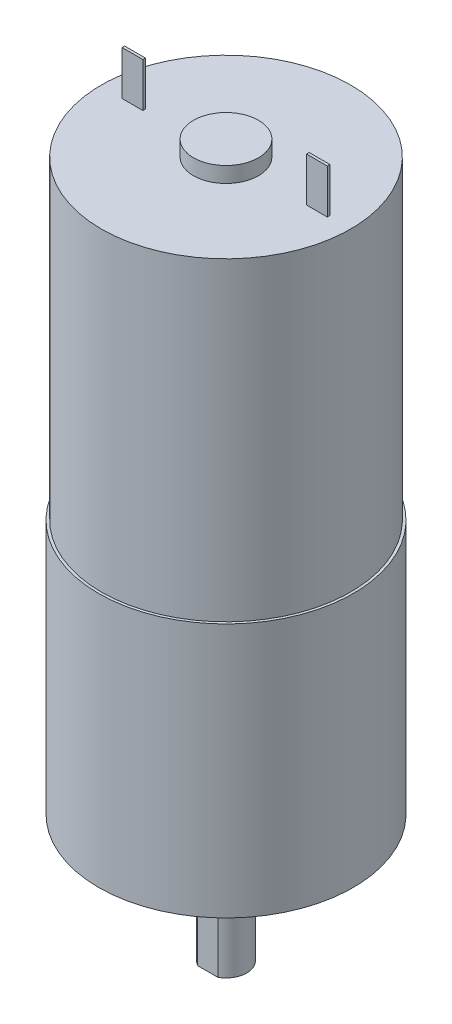
ISO-10303-21;
HEADER;
FILE_DESCRIPTION(('STEP AP214'),'2;1');
FILE_NAME('part.step','',(''),(''),'','','');
FILE_SCHEMA(('AUTOMOTIVE_DESIGN { 1 0 10303 214 1 1 1 1 }'));
ENDSEC;
DATA;
#1=APPLICATION_CONTEXT('core data for automotive mechanical design processes');
#2=APPLICATION_PROTOCOL_DEFINITION('international standard','automotive_design',2000,#1);
#3=PRODUCT_CONTEXT('',#1,'mechanical');
#4=PRODUCT('Part','Part','',(#3));
#5=PRODUCT_RELATED_PRODUCT_CATEGORY('part','',(#4));
#6=PRODUCT_DEFINITION_FORMATION('','',#4);
#7=PRODUCT_DEFINITION_CONTEXT('part definition',#1,'design');
#8=PRODUCT_DEFINITION('design','',#6,#7);
#9=PRODUCT_DEFINITION_SHAPE('','',#8);
#10=(LENGTH_UNIT() NAMED_UNIT(*) SI_UNIT(.MILLI.,.METRE.));
#11=(NAMED_UNIT(*) PLANE_ANGLE_UNIT() SI_UNIT($,.RADIAN.));
#12=(NAMED_UNIT(*) SI_UNIT($,.STERADIAN.) SOLID_ANGLE_UNIT());
#13=UNCERTAINTY_MEASURE_WITH_UNIT(LENGTH_MEASURE(1.E-05),#10,'distance_accuracy_value','');
#14=(GEOMETRIC_REPRESENTATION_CONTEXT(3) GLOBAL_UNCERTAINTY_ASSIGNED_CONTEXT((#13)) GLOBAL_UNIT_ASSIGNED_CONTEXT((#10,
#11,#12)) REPRESENTATION_CONTEXT('',''));
#15=CARTESIAN_POINT('',(0.,0.,0.));
#16=DIRECTION('',(0.,0.,1.));
#17=DIRECTION('',(1.,0.,0.));
#18=AXIS2_PLACEMENT_3D('',#15,#16,#17);
#19=CARTESIAN_POINT('',(0.,55.626,0.));
#20=DIRECTION('',(0.,1.,0.));
#21=DIRECTION('',(0.,0.,1.));
#22=AXIS2_PLACEMENT_3D('',#19,#20,#21);
#23=PLANE('',#22);
#24=CARTESIAN_POINT('',(0.,55.626,0.));
#25=DIRECTION('',(0.,1.,0.));
#26=DIRECTION('',(0.,0.,1.));
#27=AXIS2_PLACEMENT_3D('',#24,#25,#26);
#28=CIRCLE('',#27,3.175);
#29=CARTESIAN_POINT('',(0.,55.626,3.175));
#30=VERTEX_POINT('',#29);
#31=EDGE_CURVE('E11',#30,#30,#28,.T.);
#32=ORIENTED_EDGE('',*,*,#31,.F.);
#33=EDGE_LOOP('',(#32));
#34=FACE_BOUND('',#33,.T.);
#35=CARTESIAN_POINT('',(0.,55.626,0.));
#36=DIRECTION('',(0.,1.,0.));
#37=DIRECTION('',(0.,0.,1.));
#38=AXIS2_PLACEMENT_3D('',#35,#36,#37);
#39=CIRCLE('',#38,12.192);
#40=CARTESIAN_POINT('',(0.,55.626,12.192));
#41=VERTEX_POINT('',#40);
#42=EDGE_CURVE('E246',#41,#41,#39,.T.);
#43=ORIENTED_EDGE('',*,*,#42,.T.);
#44=EDGE_LOOP('',(#43));
#45=FACE_BOUND('',#44,.T.);
#46=DIRECTION('',(-1.,0.,0.));
#47=VECTOR('',#46,1.);
#48=CARTESIAN_POINT('',(-10.033,55.626,-0.126999999999998));
#49=LINE('',#48,#47);
#50=CARTESIAN_POINT('',(-8.001,55.626,-0.127000000000001));
#51=VERTEX_POINT('',#50);
#52=CARTESIAN_POINT('',(-10.033,55.626,-0.126999999999998));
#53=VERTEX_POINT('',#52);
#54=EDGE_CURVE('E164',#51,#53,#49,.T.);
#55=ORIENTED_EDGE('',*,*,#54,.F.);
#56=DIRECTION('',(0.,0.,-1.));
#57=VECTOR('',#56,1.);
#58=CARTESIAN_POINT('',(-8.001,55.626,0.126999999999999));
#59=LINE('',#58,#57);
#60=CARTESIAN_POINT('',(-8.001,55.626,0.126999999999999));
#61=VERTEX_POINT('',#60);
#62=EDGE_CURVE('E159',#61,#51,#59,.T.);
#63=ORIENTED_EDGE('',*,*,#62,.F.);
#64=DIRECTION('',(1.,0.,0.));
#65=VECTOR('',#64,1.);
#66=CARTESIAN_POINT('',(-10.033,55.626,0.126999999999998));
#67=LINE('',#66,#65);
#68=CARTESIAN_POINT('',(-10.033,55.626,0.126999999999998));
#69=VERTEX_POINT('',#68);
#70=EDGE_CURVE('E174',#69,#61,#67,.T.);
#71=ORIENTED_EDGE('',*,*,#70,.F.);
#72=DIRECTION('',(0.,0.,1.));
#73=VECTOR('',#72,1.);
#74=CARTESIAN_POINT('',(-10.033,55.626,0.126999999999998));
#75=LINE('',#74,#73);
#76=EDGE_CURVE('E186',#53,#69,#75,.T.);
#77=ORIENTED_EDGE('',*,*,#76,.F.);
#78=EDGE_LOOP('',(#55,#63,#71,#77));
#79=FACE_BOUND('',#78,.T.);
#80=DIRECTION('',(1.,0.,0.));
#81=VECTOR('',#80,1.);
#82=CARTESIAN_POINT('',(10.033,55.626,0.126999999999998));
#83=LINE('',#82,#81);
#84=CARTESIAN_POINT('',(8.00099999999998,55.626,0.126999999999998));
#85=VERTEX_POINT('',#84);
#86=CARTESIAN_POINT('',(10.033,55.626,0.126999999999998));
#87=VERTEX_POINT('',#86);
#88=EDGE_CURVE('E674',#85,#87,#83,.T.);
#89=ORIENTED_EDGE('',*,*,#88,.F.);
#90=DIRECTION('',(0.,0.,1.));
#91=VECTOR('',#90,1.);
#92=CARTESIAN_POINT('',(8.00099999999998,55.626,0.126999999999998));
#93=LINE('',#92,#91);
#94=CARTESIAN_POINT('',(8.00099999999998,55.626,-0.127000000000002));
#95=VERTEX_POINT('',#94);
#96=EDGE_CURVE('E156',#95,#85,#93,.T.);
#97=ORIENTED_EDGE('',*,*,#96,.F.);
#98=DIRECTION('',(-1.,0.,0.));
#99=VECTOR('',#98,1.);
#100=CARTESIAN_POINT('',(10.033,55.626,-0.126999999999998));
#101=LINE('',#100,#99);
#102=CARTESIAN_POINT('',(10.033,55.626,-0.126999999999998));
#103=VERTEX_POINT('',#102);
#104=EDGE_CURVE('E152',#103,#95,#101,.T.);
#105=ORIENTED_EDGE('',*,*,#104,.F.);
#106=DIRECTION('',(0.,0.,-1.));
#107=VECTOR('',#106,1.);
#108=CARTESIAN_POINT('',(10.033,55.626,0.126999999999998));
#109=LINE('',#108,#107);
#110=EDGE_CURVE('E670',#87,#103,#109,.T.);
#111=ORIENTED_EDGE('',*,*,#110,.F.);
#112=EDGE_LOOP('',(#89,#97,#105,#111));
#113=FACE_BOUND('',#112,.T.);
#114=ADVANCED_FACE('F39',(#34,#45,#79,#113),#23,.T.);
#115=CARTESIAN_POINT('',(0.,-12.446,0.));
#116=DIRECTION('',(0.,1.,0.));
#117=DIRECTION('',(0.,0.,1.));
#118=AXIS2_PLACEMENT_3D('',#115,#116,#117);
#119=CYLINDRICAL_SURFACE('',#118,2.032);
#120=CARTESIAN_POINT('',(0.,-12.446,0.));
#121=DIRECTION('',(0.,-1.,0.));
#122=DIRECTION('',(0.,0.,-1.));
#123=AXIS2_PLACEMENT_3D('',#120,#121,#122);
#124=CIRCLE('',#123,2.032);
#125=CARTESIAN_POINT('',(-0.983737769936686,-12.446,1.778));
#126=VERTEX_POINT('',#125);
#127=CARTESIAN_POINT('',(-0.983737769936686,-12.446,-1.778));
#128=VERTEX_POINT('',#127);
#129=EDGE_CURVE('E231',#126,#128,#124,.T.);
#130=ORIENTED_EDGE('',*,*,#129,.F.);
#131=DIRECTION('',(0.,1.,0.));
#132=VECTOR('',#131,1.);
#133=CARTESIAN_POINT('',(-0.983737769936686,-12.446,1.778));
#134=LINE('',#133,#132);
#135=CARTESIAN_POINT('',(-0.983737769936686,-2.54,1.778));
#136=VERTEX_POINT('',#135);
#137=EDGE_CURVE('E227',#126,#136,#134,.T.);
#138=ORIENTED_EDGE('',*,*,#137,.T.);
#139=CARTESIAN_POINT('',(0.,-2.54,0.));
#140=DIRECTION('',(0.,-1.,0.));
#141=DIRECTION('',(0.,0.,-1.));
#142=AXIS2_PLACEMENT_3D('',#139,#140,#141);
#143=CIRCLE('',#142,2.032);
#144=CARTESIAN_POINT('',(-0.983737769936686,-2.54,-1.778));
#145=VERTEX_POINT('',#144);
#146=EDGE_CURVE('E236',#136,#145,#143,.T.);
#147=ORIENTED_EDGE('',*,*,#146,.T.);
#148=DIRECTION('',(0.,1.,0.));
#149=VECTOR('',#148,1.);
#150=CARTESIAN_POINT('',(-0.983737769936686,-12.446,-1.778));
#151=LINE('',#150,#149);
#152=EDGE_CURVE('E212',#145,#128,#151,.F.);
#153=ORIENTED_EDGE('',*,*,#152,.T.);
#154=EDGE_LOOP('',(#130,#138,#147,#153));
#155=FACE_BOUND('',#154,.T.);
#156=ADVANCED_FACE('F325',(#155),#119,.T.);
#157=CARTESIAN_POINT('',(0.,24.892,0.));
#158=DIRECTION('',(0.,1.,0.));
#159=DIRECTION('',(0.,0.,1.));
#160=AXIS2_PLACEMENT_3D('',#157,#158,#159);
#161=PLANE('',#160);
#162=CARTESIAN_POINT('',(0.,24.892,0.));
#163=DIRECTION('',(0.,1.,0.));
#164=DIRECTION('',(0.,0.,1.));
#165=AXIS2_PLACEMENT_3D('',#162,#163,#164);
#166=CIRCLE('',#165,12.192);
#167=CARTESIAN_POINT('',(0.,24.892,12.192));
#168=VERTEX_POINT('',#167);
#169=EDGE_CURVE('E241',#168,#168,#166,.T.);
#170=ORIENTED_EDGE('',*,*,#169,.F.);
#171=EDGE_LOOP('',(#170));
#172=FACE_BOUND('',#171,.T.);
#173=CARTESIAN_POINT('',(0.,24.892,0.));
#174=DIRECTION('',(0.,1.,0.));
#175=DIRECTION('',(0.,0.,1.));
#176=AXIS2_PLACEMENT_3D('',#173,#174,#175);
#177=CIRCLE('',#176,12.446);
#178=CARTESIAN_POINT('',(0.,24.892,12.446));
#179=VERTEX_POINT('',#178);
#180=EDGE_CURVE('E258',#179,#179,#177,.T.);
#181=ORIENTED_EDGE('',*,*,#180,.T.);
#182=EDGE_LOOP('',(#181));
#183=FACE_BOUND('',#182,.T.);
#184=ADVANCED_FACE('F344',(#172,#183),#161,.T.);
#185=CARTESIAN_POINT('',(0.,0.,0.));
#186=DIRECTION('',(0.,1.,0.));
#187=DIRECTION('',(0.,0.,1.));
#188=AXIS2_PLACEMENT_3D('',#185,#186,#187);
#189=PLANE('',#188);
#190=CARTESIAN_POINT('',(0.,0.,0.));
#191=DIRECTION('',(0.,1.,0.));
#192=DIRECTION('',(0.,0.,1.));
#193=AXIS2_PLACEMENT_3D('',#190,#191,#192);
#194=CIRCLE('',#193,3.556);
#195=CARTESIAN_POINT('',(0.,0.,3.556));
#196=VERTEX_POINT('',#195);
#197=EDGE_CURVE('E247',#196,#196,#194,.T.);
#198=ORIENTED_EDGE('',*,*,#197,.T.);
#199=EDGE_LOOP('',(#198));
#200=FACE_BOUND('',#199,.T.);
#201=CARTESIAN_POINT('',(0.,0.,-8.11986596766364));
#202=DIRECTION('',(0.,1.,0.));
#203=DIRECTION('',(0.,0.,1.));
#204=AXIS2_PLACEMENT_3D('',#201,#202,#203);
#205=CIRCLE('',#204,1.69999999999999);
#206=CARTESIAN_POINT('',(0.,0.,-6.41986596766364));
#207=VERTEX_POINT('',#206);
#208=EDGE_CURVE('E268',#207,#207,#205,.T.);
#209=ORIENTED_EDGE('',*,*,#208,.T.);
#210=EDGE_LOOP('',(#209));
#211=FACE_BOUND('',#210,.T.);
#212=CARTESIAN_POINT('',(0.,0.,7.58703619407051));
#213=DIRECTION('',(0.,1.,0.));
#214=DIRECTION('',(0.,0.,1.));
#215=AXIS2_PLACEMENT_3D('',#212,#213,#214);
#216=CIRCLE('',#215,1.69999999999999);
#217=CARTESIAN_POINT('',(0.,0.,9.2870361940705));
#218=VERTEX_POINT('',#217);
#219=EDGE_CURVE('E280',#218,#218,#216,.T.);
#220=ORIENTED_EDGE('',*,*,#219,.T.);
#221=EDGE_LOOP('',(#220));
#222=FACE_BOUND('',#221,.T.);
#223=CARTESIAN_POINT('',(0.,0.,0.));
#224=DIRECTION('',(0.,1.,0.));
#225=DIRECTION('',(0.,0.,1.));
#226=AXIS2_PLACEMENT_3D('',#223,#224,#225);
#227=CIRCLE('',#226,12.446);
#228=CARTESIAN_POINT('',(0.,0.,12.446));
#229=VERTEX_POINT('',#228);
#230=EDGE_CURVE('E298',#229,#229,#227,.T.);
#231=ORIENTED_EDGE('',*,*,#230,.F.);
#232=EDGE_LOOP('',(#231));
#233=FACE_BOUND('',#232,.T.);
#234=CARTESIAN_POINT('',(-9.017,0.,0.));
#235=DIRECTION('',(0.,1.,0.));
#236=DIRECTION('',(0.,0.,1.));
#237=AXIS2_PLACEMENT_3D('',#234,#235,#236);
#238=CIRCLE('',#237,1.27);
#239=CARTESIAN_POINT('',(-9.017,0.,1.27));
#240=VERTEX_POINT('',#239);
#241=EDGE_CURVE('E291',#240,#240,#238,.T.);
#242=ORIENTED_EDGE('',*,*,#241,.T.);
#243=EDGE_LOOP('',(#242));
#244=FACE_BOUND('',#243,.T.);
#245=CARTESIAN_POINT('',(9.017,0.,0.));
#246=DIRECTION('',(0.,1.,0.));
#247=DIRECTION('',(0.,0.,1.));
#248=AXIS2_PLACEMENT_3D('',#245,#246,#247);
#249=CIRCLE('',#248,1.27);
#250=CARTESIAN_POINT('',(9.017,0.,1.27));
#251=VERTEX_POINT('',#250);
#252=EDGE_CURVE('E284',#251,#251,#249,.T.);
#253=ORIENTED_EDGE('',*,*,#252,.T.);
#254=EDGE_LOOP('',(#253));
#255=FACE_BOUND('',#254,.T.);
#256=ADVANCED_FACE('F386',(#200,#211,#222,#233,#244,#255),#189,.F.);
#257=CARTESIAN_POINT('',(0.,24.892,0.));
#258=DIRECTION('',(0.,-1.,0.));
#259=DIRECTION('',(0.,0.,-1.));
#260=AXIS2_PLACEMENT_3D('',#257,#258,#259);
#261=CYLINDRICAL_SURFACE('',#260,12.446);
#262=ORIENTED_EDGE('',*,*,#180,.F.);
#263=EDGE_LOOP('',(#262));
#264=FACE_BOUND('',#263,.T.);
#265=ORIENTED_EDGE('',*,*,#230,.T.);
#266=EDGE_LOOP('',(#265));
#267=FACE_BOUND('',#266,.T.);
#268=ADVANCED_FACE('F41',(#264,#267),#261,.T.);
#269=CARTESIAN_POINT('',(-9.017,24.892,0.));
#270=DIRECTION('',(0.,-1.,0.));
#271=DIRECTION('',(0.,0.,-1.));
#272=AXIS2_PLACEMENT_3D('',#269,#270,#271);
#273=CYLINDRICAL_SURFACE('',#272,1.27);
#274=CARTESIAN_POINT('',(-9.017,24.892,0.));
#275=DIRECTION('',(0.,1.,0.));
#276=DIRECTION('',(0.,0.,1.));
#277=AXIS2_PLACEMENT_3D('',#274,#275,#276);
#278=CIRCLE('',#277,1.27);
#279=CARTESIAN_POINT('',(-9.017,24.892,1.27));
#280=VERTEX_POINT('',#279);
#281=EDGE_CURVE('E276',#280,#280,#278,.T.);
#282=ORIENTED_EDGE('',*,*,#281,.T.);
#283=EDGE_LOOP('',(#282));
#284=FACE_BOUND('',#283,.T.);
#285=ORIENTED_EDGE('',*,*,#241,.F.);
#286=EDGE_LOOP('',(#285));
#287=FACE_BOUND('',#286,.T.);
#288=ADVANCED_FACE('F380',(#284,#287),#273,.F.);
#289=CARTESIAN_POINT('',(9.017,24.892,0.));
#290=DIRECTION('',(0.,-1.,0.));
#291=DIRECTION('',(0.,0.,-1.));
#292=AXIS2_PLACEMENT_3D('',#289,#290,#291);
#293=CYLINDRICAL_SURFACE('',#292,1.27);
#294=CARTESIAN_POINT('',(9.017,24.892,0.));
#295=DIRECTION('',(0.,1.,0.));
#296=DIRECTION('',(0.,0.,1.));
#297=AXIS2_PLACEMENT_3D('',#294,#295,#296);
#298=CIRCLE('',#297,1.27);
#299=CARTESIAN_POINT('',(9.017,24.892,1.27));
#300=VERTEX_POINT('',#299);
#301=EDGE_CURVE('E254',#300,#300,#298,.T.);
#302=ORIENTED_EDGE('',*,*,#301,.T.);
#303=EDGE_LOOP('',(#302));
#304=FACE_BOUND('',#303,.T.);
#305=ORIENTED_EDGE('',*,*,#252,.F.);
#306=EDGE_LOOP('',(#305));
#307=FACE_BOUND('',#306,.T.);
#308=ADVANCED_FACE('F376',(#304,#307),#293,.F.);
#309=CARTESIAN_POINT('',(0.,24.892,7.58703619407051));
#310=DIRECTION('',(0.,1.,0.));
#311=DIRECTION('',(0.,0.,1.));
#312=AXIS2_PLACEMENT_3D('',#309,#310,#311);
#313=CYLINDRICAL_SURFACE('',#312,1.7);
#314=ORIENTED_EDGE('',*,*,#219,.F.);
#315=EDGE_LOOP('',(#314));
#316=FACE_BOUND('',#315,.T.);
#317=CARTESIAN_POINT('',(0.,23.442,7.58703619407051));
#318=DIRECTION('',(0.,1.,0.));
#319=DIRECTION('',(0.,0.,1.));
#320=AXIS2_PLACEMENT_3D('',#317,#318,#319);
#321=CIRCLE('',#320,1.7);
#322=CARTESIAN_POINT('',(0.,23.442,9.28703619407051));
#323=VERTEX_POINT('',#322);
#324=EDGE_CURVE('E272',#323,#323,#321,.T.);
#325=ORIENTED_EDGE('',*,*,#324,.T.);
#326=EDGE_LOOP('',(#325));
#327=FACE_BOUND('',#326,.T.);
#328=ADVANCED_FACE('F372',(#316,#327),#313,.F.);
#329=CARTESIAN_POINT('',(0.,24.892,7.58703619407051));
#330=DIRECTION('',(0.,1.,0.));
#331=DIRECTION('',(0.,0.,1.));
#332=AXIS2_PLACEMENT_3D('',#329,#330,#331);
#333=CONICAL_SURFACE('',#332,3.15,0.785398163397449);
#334=ORIENTED_EDGE('',*,*,#324,.F.);
#335=EDGE_LOOP('',(#334));
#336=FACE_BOUND('',#335,.T.);
#337=CARTESIAN_POINT('',(0.,24.892,7.58703619407051));
#338=DIRECTION('',(0.,1.,0.));
#339=DIRECTION('',(0.,0.,1.));
#340=AXIS2_PLACEMENT_3D('',#337,#338,#339);
#341=CIRCLE('',#340,3.15);
#342=CARTESIAN_POINT('',(0.,24.892,10.7370361940705));
#343=VERTEX_POINT('',#342);
#344=EDGE_CURVE('E264',#343,#343,#341,.T.);
#345=ORIENTED_EDGE('',*,*,#344,.T.);
#346=EDGE_LOOP('',(#345));
#347=FACE_BOUND('',#346,.T.);
#348=ADVANCED_FACE('F368',(#336,#347),#333,.F.);
#349=CARTESIAN_POINT('',(0.,24.892,-8.11986596766364));
#350=DIRECTION('',(0.,1.,0.));
#351=DIRECTION('',(0.,0.,1.));
#352=AXIS2_PLACEMENT_3D('',#349,#350,#351);
#353=CYLINDRICAL_SURFACE('',#352,1.7);
#354=ORIENTED_EDGE('',*,*,#208,.F.);
#355=EDGE_LOOP('',(#354));
#356=FACE_BOUND('',#355,.T.);
#357=CARTESIAN_POINT('',(0.,23.442,-8.11986596766364));
#358=DIRECTION('',(0.,1.,0.));
#359=DIRECTION('',(0.,0.,1.));
#360=AXIS2_PLACEMENT_3D('',#357,#358,#359);
#361=CIRCLE('',#360,1.7);
#362=CARTESIAN_POINT('',(0.,23.442,-6.41986596766364));
#363=VERTEX_POINT('',#362);
#364=EDGE_CURVE('E263',#363,#363,#361,.T.);
#365=ORIENTED_EDGE('',*,*,#364,.T.);
#366=EDGE_LOOP('',(#365));
#367=FACE_BOUND('',#366,.T.);
#368=ADVANCED_FACE('F364',(#356,#367),#353,.F.);
#369=CARTESIAN_POINT('',(0.,24.892,-8.11986596766364));
#370=DIRECTION('',(0.,1.,0.));
#371=DIRECTION('',(0.,0.,1.));
#372=AXIS2_PLACEMENT_3D('',#369,#370,#371);
#373=CONICAL_SURFACE('',#372,3.15,0.785398163397449);
#374=ORIENTED_EDGE('',*,*,#364,.F.);
#375=EDGE_LOOP('',(#374));
#376=FACE_BOUND('',#375,.T.);
#377=CARTESIAN_POINT('',(0.,24.892,-8.11986596766364));
#378=DIRECTION('',(0.,1.,0.));
#379=DIRECTION('',(0.,0.,1.));
#380=AXIS2_PLACEMENT_3D('',#377,#378,#379);
#381=CIRCLE('',#380,3.15);
#382=CARTESIAN_POINT('',(0.,24.892,-4.96986596766364));
#383=VERTEX_POINT('',#382);
#384=EDGE_CURVE('E259',#383,#383,#381,.T.);
#385=ORIENTED_EDGE('',*,*,#384,.T.);
#386=EDGE_LOOP('',(#385));
#387=FACE_BOUND('',#386,.T.);
#388=ADVANCED_FACE('F360',(#376,#387),#373,.F.);
#389=CARTESIAN_POINT('',(0.,55.626,0.));
#390=DIRECTION('',(0.,-1.,0.));
#391=DIRECTION('',(0.,0.,-1.));
#392=AXIS2_PLACEMENT_3D('',#389,#390,#391);
#393=CYLINDRICAL_SURFACE('',#392,12.192);
#394=ORIENTED_EDGE('',*,*,#42,.F.);
#395=EDGE_LOOP('',(#394));
#396=FACE_BOUND('',#395,.T.);
#397=ORIENTED_EDGE('',*,*,#169,.T.);
#398=EDGE_LOOP('',(#397));
#399=FACE_BOUND('',#398,.T.);
#400=ADVANCED_FACE('F355',(#396,#399),#393,.T.);
#401=CARTESIAN_POINT('',(0.,24.892,0.));
#402=DIRECTION('',(0.,1.,0.));
#403=DIRECTION('',(0.,0.,1.));
#404=AXIS2_PLACEMENT_3D('',#401,#402,#403);
#405=PLANE('',#404);
#406=ORIENTED_EDGE('',*,*,#301,.F.);
#407=EDGE_LOOP('',(#406));
#408=FACE_BOUND('',#407,.T.);
#409=ADVANCED_FACE('F351',(#408),#405,.F.);
#410=ORIENTED_EDGE('',*,*,#281,.F.);
#411=EDGE_LOOP('',(#410));
#412=FACE_BOUND('',#411,.T.);
#413=ADVANCED_FACE('F354',(#412),#405,.F.);
#414=ORIENTED_EDGE('',*,*,#344,.F.);
#415=EDGE_LOOP('',(#414));
#416=FACE_BOUND('',#415,.T.);
#417=ADVANCED_FACE('F413',(#416),#405,.F.);
#418=ORIENTED_EDGE('',*,*,#384,.F.);
#419=EDGE_LOOP('',(#418));
#420=FACE_BOUND('',#419,.T.);
#421=ADVANCED_FACE('F357',(#420),#405,.F.);
#422=CARTESIAN_POINT('',(0.,-2.54,0.));
#423=DIRECTION('',(0.,1.,0.));
#424=DIRECTION('',(0.,0.,1.));
#425=AXIS2_PLACEMENT_3D('',#422,#423,#424);
#426=CYLINDRICAL_SURFACE('',#425,3.556);
#427=CARTESIAN_POINT('',(0.,-2.54,0.));
#428=DIRECTION('',(0.,1.,0.));
#429=DIRECTION('',(0.,0.,1.));
#430=AXIS2_PLACEMENT_3D('',#427,#428,#429);
#431=CIRCLE('',#430,3.556);
#432=CARTESIAN_POINT('',(0.,-2.54,3.556));
#433=VERTEX_POINT('',#432);
#434=EDGE_CURVE('E242',#433,#433,#431,.T.);
#435=ORIENTED_EDGE('',*,*,#434,.T.);
#436=EDGE_LOOP('',(#435));
#437=FACE_BOUND('',#436,.T.);
#438=ORIENTED_EDGE('',*,*,#197,.F.);
#439=EDGE_LOOP('',(#438));
#440=FACE_BOUND('',#439,.T.);
#441=ADVANCED_FACE('F349',(#437,#440),#426,.T.);
#442=CARTESIAN_POINT('',(0.,-2.54,0.));
#443=DIRECTION('',(0.,1.,0.));
#444=DIRECTION('',(0.,0.,1.));
#445=AXIS2_PLACEMENT_3D('',#442,#443,#444);
#446=PLANE('',#445);
#447=DIRECTION('',(1.,0.,0.));
#448=VECTOR('',#447,1.);
#449=CARTESIAN_POINT('',(1.016,-2.54,1.778));
#450=LINE('',#449,#448);
#451=CARTESIAN_POINT('',(0.983737769936686,-2.54,1.778));
#452=VERTEX_POINT('',#451);
#453=EDGE_CURVE('E208',#136,#452,#450,.T.);
#454=ORIENTED_EDGE('',*,*,#453,.T.);
#455=CARTESIAN_POINT('',(0.983737769936686,-2.54,-1.778));
#456=VERTEX_POINT('',#455);
#457=EDGE_CURVE('E240',#456,#452,#143,.T.);
#458=ORIENTED_EDGE('',*,*,#457,.F.);
#459=DIRECTION('',(-1.,0.,0.));
#460=VECTOR('',#459,1.);
#461=CARTESIAN_POINT('',(1.016,-2.54,-1.778));
#462=LINE('',#461,#460);
#463=EDGE_CURVE('E206',#456,#145,#462,.T.);
#464=ORIENTED_EDGE('',*,*,#463,.T.);
#465=ORIENTED_EDGE('',*,*,#146,.F.);
#466=EDGE_LOOP('',(#454,#458,#464,#465));
#467=FACE_BOUND('',#466,.T.);
#468=ORIENTED_EDGE('',*,*,#434,.F.);
#469=EDGE_LOOP('',(#468));
#470=FACE_BOUND('',#469,.T.);
#471=ADVANCED_FACE('F317',(#467,#470),#446,.F.);
#472=ORIENTED_EDGE('',*,*,#457,.T.);
#473=DIRECTION('',(0.,1.,0.));
#474=VECTOR('',#473,1.);
#475=CARTESIAN_POINT('',(0.983737769936686,-12.446,1.778));
#476=LINE('',#475,#474);
#477=CARTESIAN_POINT('',(0.983737769936686,-12.446,1.778));
#478=VERTEX_POINT('',#477);
#479=EDGE_CURVE('E223',#452,#478,#476,.F.);
#480=ORIENTED_EDGE('',*,*,#479,.T.);
#481=CARTESIAN_POINT('',(0.983737769936686,-12.446,-1.778));
#482=VERTEX_POINT('',#481);
#483=EDGE_CURVE('E235',#482,#478,#124,.T.);
#484=ORIENTED_EDGE('',*,*,#483,.F.);
#485=DIRECTION('',(0.,1.,0.));
#486=VECTOR('',#485,1.);
#487=CARTESIAN_POINT('',(0.983737769936686,-12.446,-1.778));
#488=LINE('',#487,#486);
#489=EDGE_CURVE('E219',#482,#456,#488,.T.);
#490=ORIENTED_EDGE('',*,*,#489,.T.);
#491=EDGE_LOOP('',(#472,#480,#484,#490));
#492=FACE_BOUND('',#491,.T.);
#493=ADVANCED_FACE('F313',(#492),#119,.T.);
#494=CARTESIAN_POINT('',(0.,-12.446,0.));
#495=DIRECTION('',(0.,-1.,0.));
#496=DIRECTION('',(0.,0.,-1.));
#497=AXIS2_PLACEMENT_3D('',#494,#495,#496);
#498=PLANE('',#497);
#499=DIRECTION('',(1.,0.,0.));
#500=VECTOR('',#499,1.);
#501=CARTESIAN_POINT('',(0.,-12.446,1.778));
#502=LINE('',#501,#500);
#503=EDGE_CURVE('E43',#126,#478,#502,.T.);
#504=ORIENTED_EDGE('',*,*,#503,.F.);
#505=ORIENTED_EDGE('',*,*,#129,.T.);
#506=DIRECTION('',(-1.,0.,0.));
#507=VECTOR('',#506,1.);
#508=CARTESIAN_POINT('',(0.,-12.446,-1.778));
#509=LINE('',#508,#507);
#510=EDGE_CURVE('E304',#482,#128,#509,.T.);
#511=ORIENTED_EDGE('',*,*,#510,.F.);
#512=ORIENTED_EDGE('',*,*,#483,.T.);
#513=EDGE_LOOP('',(#504,#505,#511,#512));
#514=FACE_BOUND('',#513,.T.);
#515=ADVANCED_FACE('F327',(#514),#498,.T.);
#516=CARTESIAN_POINT('',(1.016,-2.54,-1.778));
#517=DIRECTION('',(0.,0.,1.));
#518=DIRECTION('',(1.,0.,0.));
#519=AXIS2_PLACEMENT_3D('',#516,#517,#518);
#520=PLANE('',#519);
#521=ORIENTED_EDGE('',*,*,#510,.T.);
#522=ORIENTED_EDGE('',*,*,#152,.F.);
#523=ORIENTED_EDGE('',*,*,#463,.F.);
#524=ORIENTED_EDGE('',*,*,#489,.F.);
#525=EDGE_LOOP('',(#521,#522,#523,#524));
#526=FACE_BOUND('',#525,.T.);
#527=ADVANCED_FACE('F330',(#526),#520,.F.);
#528=CARTESIAN_POINT('',(1.016,-2.54,1.778));
#529=DIRECTION('',(0.,0.,-1.));
#530=DIRECTION('',(-1.,0.,0.));
#531=AXIS2_PLACEMENT_3D('',#528,#529,#530);
#532=PLANE('',#531);
#533=ORIENTED_EDGE('',*,*,#503,.T.);
#534=ORIENTED_EDGE('',*,*,#479,.F.);
#535=ORIENTED_EDGE('',*,*,#453,.F.);
#536=ORIENTED_EDGE('',*,*,#137,.F.);
#537=EDGE_LOOP('',(#533,#534,#535,#536));
#538=FACE_BOUND('',#537,.T.);
#539=ADVANCED_FACE('F321',(#538),#532,.F.);
#540=CARTESIAN_POINT('',(0.,57.15,0.));
#541=DIRECTION('',(0.,-1.,0.));
#542=DIRECTION('',(0.,0.,-1.));
#543=AXIS2_PLACEMENT_3D('',#540,#541,#542);
#544=CYLINDRICAL_SURFACE('',#543,3.175);
#545=CARTESIAN_POINT('',(0.,57.15,0.));
#546=DIRECTION('',(0.,1.,0.));
#547=DIRECTION('',(0.,0.,1.));
#548=AXIS2_PLACEMENT_3D('',#545,#546,#547);
#549=CIRCLE('',#548,3.175);
#550=CARTESIAN_POINT('',(0.,57.15,3.175));
#551=VERTEX_POINT('',#550);
#552=EDGE_CURVE('E203',#551,#551,#549,.T.);
#553=ORIENTED_EDGE('',*,*,#552,.F.);
#554=EDGE_LOOP('',(#553));
#555=FACE_BOUND('',#554,.T.);
#556=ORIENTED_EDGE('',*,*,#31,.T.);
#557=EDGE_LOOP('',(#556));
#558=FACE_BOUND('',#557,.T.);
#559=ADVANCED_FACE('F546',(#555,#558),#544,.T.);
#560=CARTESIAN_POINT('',(0.,57.15,0.));
#561=DIRECTION('',(0.,1.,0.));
#562=DIRECTION('',(0.,0.,1.));
#563=AXIS2_PLACEMENT_3D('',#560,#561,#562);
#564=PLANE('',#563);
#565=ORIENTED_EDGE('',*,*,#552,.T.);
#566=EDGE_LOOP('',(#565));
#567=FACE_BOUND('',#566,.T.);
#568=ADVANCED_FACE('F555',(#567),#564,.T.);
#569=CARTESIAN_POINT('',(-8.001,59.944,0.126999999999999));
#570=DIRECTION('',(-1.,0.,0.));
#571=DIRECTION('',(0.,0.,1.));
#572=AXIS2_PLACEMENT_3D('',#569,#570,#571);
#573=PLANE('',#572);
#574=ORIENTED_EDGE('',*,*,#62,.T.);
#575=DIRECTION('',(0.,-1.,0.));
#576=VECTOR('',#575,1.);
#577=CARTESIAN_POINT('',(-8.001,59.944,-0.127000000000001));
#578=LINE('',#577,#576);
#579=CARTESIAN_POINT('',(-8.001,59.944,-0.127000000000001));
#580=VERTEX_POINT('',#579);
#581=EDGE_CURVE('E200',#580,#51,#578,.T.);
#582=ORIENTED_EDGE('',*,*,#581,.F.);
#583=DIRECTION('',(0.,0.,-1.));
#584=VECTOR('',#583,1.);
#585=CARTESIAN_POINT('',(-8.001,59.944,0.126999999999999));
#586=LINE('',#585,#584);
#587=CARTESIAN_POINT('',(-8.001,59.944,0.126999999999999));
#588=VERTEX_POINT('',#587);
#589=EDGE_CURVE('E169',#588,#580,#586,.T.);
#590=ORIENTED_EDGE('',*,*,#589,.F.);
#591=DIRECTION('',(0.,-1.,0.));
#592=VECTOR('',#591,1.);
#593=CARTESIAN_POINT('',(-8.001,59.944,0.126999999999999));
#594=LINE('',#593,#592);
#595=EDGE_CURVE('E182',#588,#61,#594,.T.);
#596=ORIENTED_EDGE('',*,*,#595,.T.);
#597=EDGE_LOOP('',(#574,#582,#590,#596));
#598=FACE_BOUND('',#597,.T.);
#599=ADVANCED_FACE('F564',(#598),#573,.F.);
#600=CARTESIAN_POINT('',(-10.033,59.944,-0.126999999999998));
#601=DIRECTION('',(0.,0.,1.));
#602=DIRECTION('',(1.,0.,0.));
#603=AXIS2_PLACEMENT_3D('',#600,#601,#602);
#604=PLANE('',#603);
#605=ORIENTED_EDGE('',*,*,#54,.T.);
#606=DIRECTION('',(0.,-1.,0.));
#607=VECTOR('',#606,1.);
#608=CARTESIAN_POINT('',(-10.033,59.944,-0.126999999999998));
#609=LINE('',#608,#607);
#610=CARTESIAN_POINT('',(-10.033,59.944,-0.126999999999998));
#611=VERTEX_POINT('',#610);
#612=EDGE_CURVE('E196',#611,#53,#609,.T.);
#613=ORIENTED_EDGE('',*,*,#612,.F.);
#614=DIRECTION('',(-1.,0.,0.));
#615=VECTOR('',#614,1.);
#616=CARTESIAN_POINT('',(-10.033,59.944,-0.126999999999998));
#617=LINE('',#616,#615);
#618=EDGE_CURVE('E173',#580,#611,#617,.T.);
#619=ORIENTED_EDGE('',*,*,#618,.F.);
#620=ORIENTED_EDGE('',*,*,#581,.T.);
#621=EDGE_LOOP('',(#605,#613,#619,#620));
#622=FACE_BOUND('',#621,.T.);
#623=ADVANCED_FACE('F579',(#622),#604,.F.);
#624=CARTESIAN_POINT('',(-10.033,59.944,0.126999999999998));
#625=DIRECTION('',(1.,0.,0.));
#626=DIRECTION('',(0.,0.,-1.));
#627=AXIS2_PLACEMENT_3D('',#624,#625,#626);
#628=PLANE('',#627);
#629=ORIENTED_EDGE('',*,*,#76,.T.);
#630=DIRECTION('',(0.,-1.,0.));
#631=VECTOR('',#630,1.);
#632=CARTESIAN_POINT('',(-10.033,59.944,0.126999999999998));
#633=LINE('',#632,#631);
#634=CARTESIAN_POINT('',(-10.033,59.944,0.126999999999998));
#635=VERTEX_POINT('',#634);
#636=EDGE_CURVE('E64',#635,#69,#633,.T.);
#637=ORIENTED_EDGE('',*,*,#636,.F.);
#638=DIRECTION('',(0.,0.,1.));
#639=VECTOR('',#638,1.);
#640=CARTESIAN_POINT('',(-10.033,59.944,0.126999999999998));
#641=LINE('',#640,#639);
#642=EDGE_CURVE('E177',#611,#635,#641,.T.);
#643=ORIENTED_EDGE('',*,*,#642,.F.);
#644=ORIENTED_EDGE('',*,*,#612,.T.);
#645=EDGE_LOOP('',(#629,#637,#643,#644));
#646=FACE_BOUND('',#645,.T.);
#647=ADVANCED_FACE('F589',(#646),#628,.F.);
#648=CARTESIAN_POINT('',(-10.033,59.944,0.126999999999998));
#649=DIRECTION('',(0.,0.,-1.));
#650=DIRECTION('',(-1.,0.,0.));
#651=AXIS2_PLACEMENT_3D('',#648,#649,#650);
#652=PLANE('',#651);
#653=ORIENTED_EDGE('',*,*,#70,.T.);
#654=ORIENTED_EDGE('',*,*,#595,.F.);
#655=DIRECTION('',(1.,0.,0.));
#656=VECTOR('',#655,1.);
#657=CARTESIAN_POINT('',(-10.033,59.944,0.126999999999998));
#658=LINE('',#657,#656);
#659=EDGE_CURVE('E180',#635,#588,#658,.T.);
#660=ORIENTED_EDGE('',*,*,#659,.F.);
#661=ORIENTED_EDGE('',*,*,#636,.T.);
#662=EDGE_LOOP('',(#653,#654,#660,#661));
#663=FACE_BOUND('',#662,.T.);
#664=ADVANCED_FACE('F599',(#663),#652,.F.);
#665=CARTESIAN_POINT('',(0.,59.944,0.));
#666=DIRECTION('',(0.,-1.,0.));
#667=DIRECTION('',(0.,0.,-1.));
#668=AXIS2_PLACEMENT_3D('',#665,#666,#667);
#669=PLANE('',#668);
#670=ORIENTED_EDGE('',*,*,#589,.T.);
#671=ORIENTED_EDGE('',*,*,#618,.T.);
#672=ORIENTED_EDGE('',*,*,#642,.T.);
#673=ORIENTED_EDGE('',*,*,#659,.T.);
#674=EDGE_LOOP('',(#670,#671,#672,#673));
#675=FACE_BOUND('',#674,.T.);
#676=ADVANCED_FACE('F609',(#675),#669,.F.);
#677=CARTESIAN_POINT('',(8.00099999999998,59.944,0.126999999999998));
#678=DIRECTION('',(1.,0.,0.));
#679=DIRECTION('',(0.,0.,-1.));
#680=AXIS2_PLACEMENT_3D('',#677,#678,#679);
#681=PLANE('',#680);
#682=ORIENTED_EDGE('',*,*,#96,.T.);
#683=DIRECTION('',(0.,-1.,0.));
#684=VECTOR('',#683,1.);
#685=CARTESIAN_POINT('',(8.00099999999998,59.944,0.126999999999998));
#686=LINE('',#685,#684);
#687=CARTESIAN_POINT('',(8.00099999999998,59.944,0.126999999999998));
#688=VERTEX_POINT('',#687);
#689=EDGE_CURVE('E135',#688,#85,#686,.T.);
#690=ORIENTED_EDGE('',*,*,#689,.F.);
#691=DIRECTION('',(0.,0.,1.));
#692=VECTOR('',#691,1.);
#693=CARTESIAN_POINT('',(8.00099999999998,59.944,0.126999999999998));
#694=LINE('',#693,#692);
#695=CARTESIAN_POINT('',(8.00099999999998,59.944,-0.127000000000002));
#696=VERTEX_POINT('',#695);
#697=EDGE_CURVE('E143',#696,#688,#694,.T.);
#698=ORIENTED_EDGE('',*,*,#697,.F.);
#699=DIRECTION('',(0.,-1.,0.));
#700=VECTOR('',#699,1.);
#701=CARTESIAN_POINT('',(8.00099999999998,59.944,-0.127000000000002));
#702=LINE('',#701,#700);
#703=EDGE_CURVE('E666',#696,#95,#702,.T.);
#704=ORIENTED_EDGE('',*,*,#703,.T.);
#705=EDGE_LOOP('',(#682,#690,#698,#704));
#706=FACE_BOUND('',#705,.T.);
#707=ADVANCED_FACE('F154',(#706),#681,.F.);
#708=CARTESIAN_POINT('',(10.033,59.944,0.126999999999998));
#709=DIRECTION('',(0.,0.,-1.));
#710=DIRECTION('',(-1.,0.,0.));
#711=AXIS2_PLACEMENT_3D('',#708,#709,#710);
#712=PLANE('',#711);
#713=ORIENTED_EDGE('',*,*,#88,.T.);
#714=DIRECTION('',(0.,-1.,0.));
#715=VECTOR('',#714,1.);
#716=CARTESIAN_POINT('',(10.033,59.944,0.126999999999998));
#717=LINE('',#716,#715);
#718=CARTESIAN_POINT('',(10.033,59.944,0.126999999999998));
#719=VERTEX_POINT('',#718);
#720=EDGE_CURVE('E138',#719,#87,#717,.T.);
#721=ORIENTED_EDGE('',*,*,#720,.F.);
#722=DIRECTION('',(1.,0.,0.));
#723=VECTOR('',#722,1.);
#724=CARTESIAN_POINT('',(10.033,59.944,0.126999999999998));
#725=LINE('',#724,#723);
#726=EDGE_CURVE('E131',#688,#719,#725,.T.);
#727=ORIENTED_EDGE('',*,*,#726,.F.);
#728=ORIENTED_EDGE('',*,*,#689,.T.);
#729=EDGE_LOOP('',(#713,#721,#727,#728));
#730=FACE_BOUND('',#729,.T.);
#731=ADVANCED_FACE('F133',(#730),#712,.F.);
#732=CARTESIAN_POINT('',(10.033,59.944,0.126999999999998));
#733=DIRECTION('',(-1.,0.,0.));
#734=DIRECTION('',(0.,0.,1.));
#735=AXIS2_PLACEMENT_3D('',#732,#733,#734);
#736=PLANE('',#735);
#737=ORIENTED_EDGE('',*,*,#110,.T.);
#738=DIRECTION('',(0.,-1.,0.));
#739=VECTOR('',#738,1.);
#740=CARTESIAN_POINT('',(10.033,59.944,-0.126999999999998));
#741=LINE('',#740,#739);
#742=CARTESIAN_POINT('',(10.033,59.944,-0.126999999999998));
#743=VERTEX_POINT('',#742);
#744=EDGE_CURVE('E56',#743,#103,#741,.T.);
#745=ORIENTED_EDGE('',*,*,#744,.F.);
#746=DIRECTION('',(0.,0.,-1.));
#747=VECTOR('',#746,1.);
#748=CARTESIAN_POINT('',(10.033,59.944,0.126999999999998));
#749=LINE('',#748,#747);
#750=EDGE_CURVE('E142',#719,#743,#749,.T.);
#751=ORIENTED_EDGE('',*,*,#750,.F.);
#752=ORIENTED_EDGE('',*,*,#720,.T.);
#753=EDGE_LOOP('',(#737,#745,#751,#752));
#754=FACE_BOUND('',#753,.T.);
#755=ADVANCED_FACE('F635',(#754),#736,.F.);
#756=CARTESIAN_POINT('',(10.033,59.944,-0.126999999999998));
#757=DIRECTION('',(0.,0.,1.));
#758=DIRECTION('',(1.,0.,0.));
#759=AXIS2_PLACEMENT_3D('',#756,#757,#758);
#760=PLANE('',#759);
#761=ORIENTED_EDGE('',*,*,#104,.T.);
#762=ORIENTED_EDGE('',*,*,#703,.F.);
#763=DIRECTION('',(-1.,0.,0.));
#764=VECTOR('',#763,1.);
#765=CARTESIAN_POINT('',(10.033,59.944,-0.126999999999998));
#766=LINE('',#765,#764);
#767=EDGE_CURVE('E147',#743,#696,#766,.T.);
#768=ORIENTED_EDGE('',*,*,#767,.F.);
#769=ORIENTED_EDGE('',*,*,#744,.T.);
#770=EDGE_LOOP('',(#761,#762,#768,#769));
#771=FACE_BOUND('',#770,.T.);
#772=ADVANCED_FACE('F644',(#771),#760,.F.);
#773=CARTESIAN_POINT('',(0.,59.944,0.));
#774=DIRECTION('',(0.,1.,0.));
#775=DIRECTION('',(0.,0.,1.));
#776=AXIS2_PLACEMENT_3D('',#773,#774,#775);
#777=PLANE('',#776);
#778=ORIENTED_EDGE('',*,*,#697,.T.);
#779=ORIENTED_EDGE('',*,*,#726,.T.);
#780=ORIENTED_EDGE('',*,*,#750,.T.);
#781=ORIENTED_EDGE('',*,*,#767,.T.);
#782=EDGE_LOOP('',(#778,#779,#780,#781));
#783=FACE_BOUND('',#782,.T.);
#784=ADVANCED_FACE('F146',(#783),#777,.T.);
#785=CLOSED_SHELL('',(#114,#156,#184,#256,#268,#288,#308,#328,#348,#368,#388,#400,#409,#413,
#417,#421,#441,#471,#493,#515,#527,#539,#559,#568,#599,#623,#647,#664,#676,#707,#731,#755,#772,#784));
#786=MANIFOLD_SOLID_BREP('B2',#785);
#787=ADVANCED_BREP_SHAPE_REPRESENTATION('',(#18,#786),#14);
#788=SHAPE_DEFINITION_REPRESENTATION(#9,#787);
ENDSEC;
END-ISO-10303-21;
